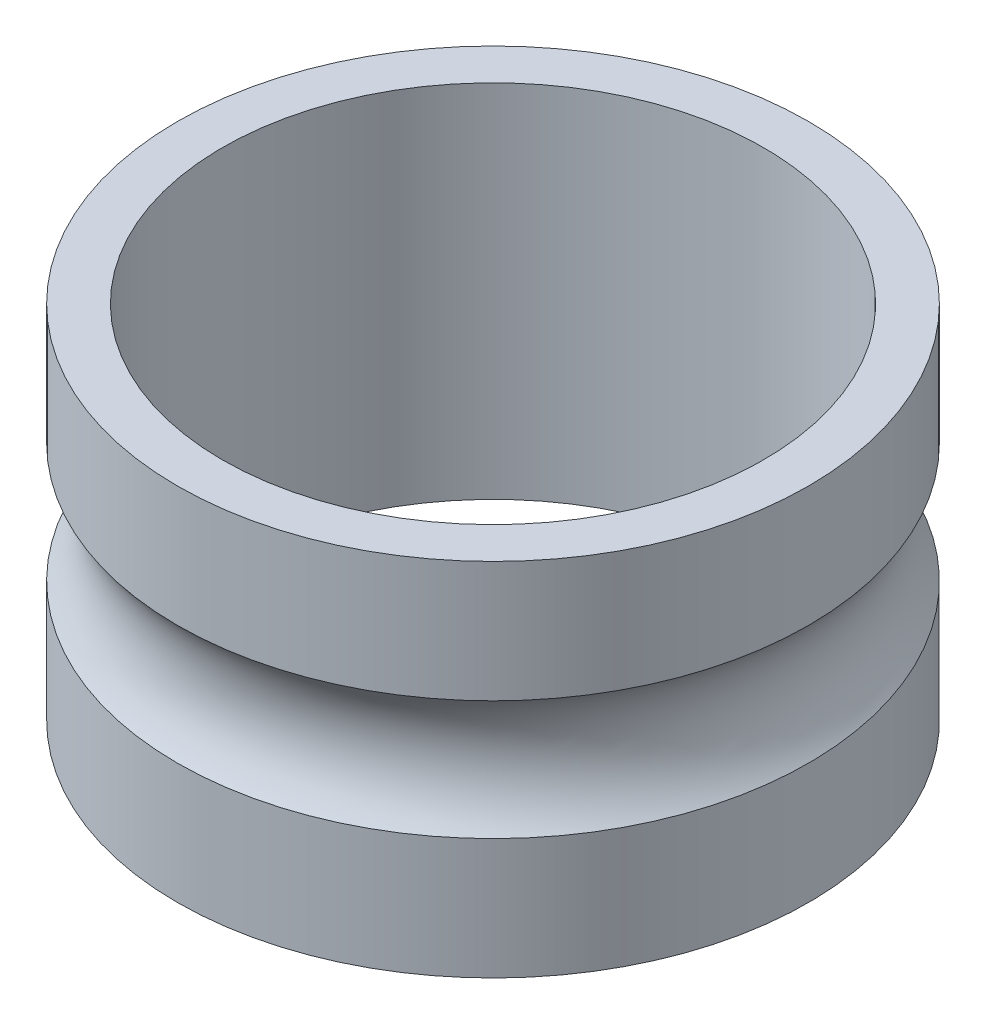
ISO-10303-21;
HEADER;
FILE_DESCRIPTION(('STEP AP214'),'2;1');
FILE_NAME('part.step','',(''),(''),'','','');
FILE_SCHEMA(('AUTOMOTIVE_DESIGN { 1 0 10303 214 1 1 1 1 }'));
ENDSEC;
DATA;
#1=APPLICATION_CONTEXT('core data for automotive mechanical design processes');
#2=APPLICATION_PROTOCOL_DEFINITION('international standard','automotive_design',2000,#1);
#3=PRODUCT_CONTEXT('',#1,'mechanical');
#4=PRODUCT('Part','Part','',(#3));
#5=PRODUCT_RELATED_PRODUCT_CATEGORY('part','',(#4));
#6=PRODUCT_DEFINITION_FORMATION('','',#4);
#7=PRODUCT_DEFINITION_CONTEXT('part definition',#1,'design');
#8=PRODUCT_DEFINITION('design','',#6,#7);
#9=PRODUCT_DEFINITION_SHAPE('','',#8);
#10=(LENGTH_UNIT() NAMED_UNIT(*) SI_UNIT(.MILLI.,.METRE.));
#11=(NAMED_UNIT(*) PLANE_ANGLE_UNIT() SI_UNIT($,.RADIAN.));
#12=(NAMED_UNIT(*) SI_UNIT($,.STERADIAN.) SOLID_ANGLE_UNIT());
#13=UNCERTAINTY_MEASURE_WITH_UNIT(LENGTH_MEASURE(1.E-05),#10,'distance_accuracy_value','');
#14=(GEOMETRIC_REPRESENTATION_CONTEXT(3) GLOBAL_UNCERTAINTY_ASSIGNED_CONTEXT((#13)) GLOBAL_UNIT_ASSIGNED_CONTEXT((#10,
#11,#12)) REPRESENTATION_CONTEXT('',''));
#15=CARTESIAN_POINT('',(0.,0.,0.));
#16=DIRECTION('',(0.,0.,1.));
#17=DIRECTION('',(1.,0.,0.));
#18=AXIS2_PLACEMENT_3D('',#15,#16,#17);
#19=CARTESIAN_POINT('',(0.,1.,0.));
#20=DIRECTION('',(0.,-1.,0.));
#21=DIRECTION('',(0.,0.,-1.));
#22=AXIS2_PLACEMENT_3D('',#19,#20,#21);
#23=CYLINDRICAL_SURFACE('',#22,1.75);
#24=CARTESIAN_POINT('',(0.,1.,0.));
#25=DIRECTION('',(0.,1.,0.));
#26=DIRECTION('',(0.,0.,1.));
#27=AXIS2_PLACEMENT_3D('',#24,#25,#26);
#28=CIRCLE('',#27,1.75);
#29=CARTESIAN_POINT('',(0.,1.,1.75));
#30=VERTEX_POINT('',#29);
#31=EDGE_CURVE('E10',#30,#30,#28,.T.);
#32=ORIENTED_EDGE('',*,*,#31,.F.);
#33=EDGE_LOOP('',(#32));
#34=FACE_BOUND('',#33,.T.);
#35=CARTESIAN_POINT('',(0.,0.330718913883074,0.));
#36=DIRECTION('',(0.,-1.,0.));
#37=DIRECTION('',(0.,0.,-1.));
#38=AXIS2_PLACEMENT_3D('',#35,#36,#37);
#39=CIRCLE('',#38,1.75);
#40=CARTESIAN_POINT('',(0.,0.330718913883074,-1.75));
#41=VERTEX_POINT('',#40);
#42=EDGE_CURVE('E38',#41,#41,#39,.T.);
#43=ORIENTED_EDGE('',*,*,#42,.F.);
#44=EDGE_LOOP('',(#43));
#45=FACE_BOUND('',#44,.T.);
#46=ADVANCED_FACE('F35',(#34,#45),#23,.T.);
#47=CARTESIAN_POINT('',(0.,-1.,0.));
#48=DIRECTION('',(0.,1.,0.));
#49=DIRECTION('',(0.,0.,1.));
#50=AXIS2_PLACEMENT_3D('',#47,#48,#49);
#51=CIRCLE('',#50,1.75);
#52=CARTESIAN_POINT('',(0.,-1.,1.75));
#53=VERTEX_POINT('',#52);
#54=EDGE_CURVE('E42',#53,#53,#51,.T.);
#55=ORIENTED_EDGE('',*,*,#54,.T.);
#56=EDGE_LOOP('',(#55));
#57=FACE_BOUND('',#56,.T.);
#58=CARTESIAN_POINT('',(0.,-0.330718913883074,0.));
#59=DIRECTION('',(0.,1.,0.));
#60=DIRECTION('',(0.,0.,1.));
#61=AXIS2_PLACEMENT_3D('',#58,#59,#60);
#62=CIRCLE('',#61,1.75);
#63=CARTESIAN_POINT('',(0.,-0.330718913883074,1.75));
#64=VERTEX_POINT('',#63);
#65=EDGE_CURVE('E52',#64,#64,#62,.T.);
#66=ORIENTED_EDGE('',*,*,#65,.F.);
#67=EDGE_LOOP('',(#66));
#68=FACE_BOUND('',#67,.T.);
#69=ADVANCED_FACE('F71',(#57,#68),#23,.T.);
#70=CARTESIAN_POINT('',(0.,1.,0.));
#71=DIRECTION('',(0.,1.,0.));
#72=DIRECTION('',(0.,0.,1.));
#73=AXIS2_PLACEMENT_3D('',#70,#71,#72);
#74=PLANE('',#73);
#75=ORIENTED_EDGE('',*,*,#31,.T.);
#76=EDGE_LOOP('',(#75));
#77=FACE_BOUND('',#76,.T.);
#78=CARTESIAN_POINT('',(0.,1.,0.));
#79=DIRECTION('',(0.,1.,0.));
#80=DIRECTION('',(0.,0.,1.));
#81=AXIS2_PLACEMENT_3D('',#78,#79,#80);
#82=CIRCLE('',#81,1.5);
#83=CARTESIAN_POINT('',(0.,1.,1.5));
#84=VERTEX_POINT('',#83);
#85=EDGE_CURVE('E47',#84,#84,#82,.T.);
#86=ORIENTED_EDGE('',*,*,#85,.F.);
#87=EDGE_LOOP('',(#86));
#88=FACE_BOUND('',#87,.T.);
#89=ADVANCED_FACE('F68',(#77,#88),#74,.T.);
#90=CARTESIAN_POINT('',(0.,-1.,0.));
#91=DIRECTION('',(0.,1.,0.));
#92=DIRECTION('',(0.,0.,1.));
#93=AXIS2_PLACEMENT_3D('',#90,#91,#92);
#94=PLANE('',#93);
#95=ORIENTED_EDGE('',*,*,#54,.F.);
#96=EDGE_LOOP('',(#95));
#97=FACE_BOUND('',#96,.T.);
#98=CARTESIAN_POINT('',(0.,-1.,0.));
#99=DIRECTION('',(0.,1.,0.));
#100=DIRECTION('',(0.,0.,1.));
#101=AXIS2_PLACEMENT_3D('',#98,#99,#100);
#102=CIRCLE('',#101,1.5);
#103=CARTESIAN_POINT('',(0.,-1.,1.5));
#104=VERTEX_POINT('',#103);
#105=EDGE_CURVE('E50',#104,#104,#102,.T.);
#106=ORIENTED_EDGE('',*,*,#105,.T.);
#107=EDGE_LOOP('',(#106));
#108=FACE_BOUND('',#107,.T.);
#109=ADVANCED_FACE('F70',(#97,#108),#94,.F.);
#110=CARTESIAN_POINT('',(0.,1.,0.));
#111=DIRECTION('',(0.,-1.,0.));
#112=DIRECTION('',(0.,0.,-1.));
#113=AXIS2_PLACEMENT_3D('',#110,#111,#112);
#114=CYLINDRICAL_SURFACE('',#113,1.5);
#115=ORIENTED_EDGE('',*,*,#85,.T.);
#116=EDGE_LOOP('',(#115));
#117=FACE_BOUND('',#116,.T.);
#118=ORIENTED_EDGE('',*,*,#105,.F.);
#119=EDGE_LOOP('',(#118));
#120=FACE_BOUND('',#119,.T.);
#121=ADVANCED_FACE('F65',(#117,#120),#114,.F.);
#122=CARTESIAN_POINT('',(0.,0.,0.));
#123=DIRECTION('',(0.,1.,0.));
#124=DIRECTION('',(0.,0.,1.));
#125=AXIS2_PLACEMENT_3D('',#122,#123,#124);
#126=TOROIDAL_SURFACE('',#125,2.125,0.5);
#127=ORIENTED_EDGE('',*,*,#65,.T.);
#128=EDGE_LOOP('',(#127));
#129=FACE_BOUND('',#128,.T.);
#130=ORIENTED_EDGE('',*,*,#42,.T.);
#131=EDGE_LOOP('',(#130));
#132=FACE_BOUND('',#131,.T.);
#133=ADVANCED_FACE('F96',(#129,#132),#126,.F.);
#134=CLOSED_SHELL('',(#46,#69,#89,#109,#121,#133));
#135=MANIFOLD_SOLID_BREP('B2',#134);
#136=ADVANCED_BREP_SHAPE_REPRESENTATION('',(#18,#135),#14);
#137=SHAPE_DEFINITION_REPRESENTATION(#9,#136);
ENDSEC;
END-ISO-10303-21;
